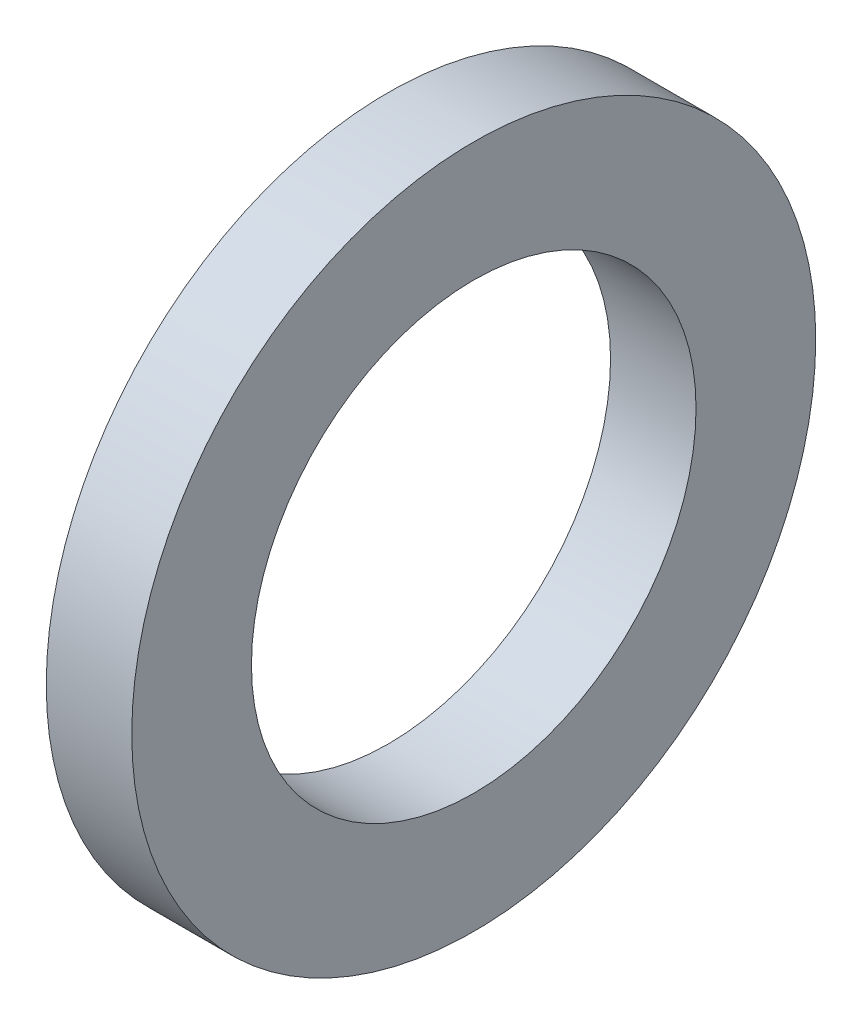
ISO-10303-21;
HEADER;
FILE_DESCRIPTION(('STEP AP214'),'2;1');
FILE_NAME('part.step','',(''),(''),'','','');
FILE_SCHEMA(('AUTOMOTIVE_DESIGN { 1 0 10303 214 1 1 1 1 }'));
ENDSEC;
DATA;
#1=APPLICATION_CONTEXT('core data for automotive mechanical design processes');
#2=APPLICATION_PROTOCOL_DEFINITION('international standard','automotive_design',2000,#1);
#3=PRODUCT_CONTEXT('',#1,'mechanical');
#4=PRODUCT('Part','Part','',(#3));
#5=PRODUCT_RELATED_PRODUCT_CATEGORY('part','',(#4));
#6=PRODUCT_DEFINITION_FORMATION('','',#4);
#7=PRODUCT_DEFINITION_CONTEXT('part definition',#1,'design');
#8=PRODUCT_DEFINITION('design','',#6,#7);
#9=PRODUCT_DEFINITION_SHAPE('','',#8);
#10=(LENGTH_UNIT() NAMED_UNIT(*) SI_UNIT(.MILLI.,.METRE.));
#11=(NAMED_UNIT(*) PLANE_ANGLE_UNIT() SI_UNIT($,.RADIAN.));
#12=(NAMED_UNIT(*) SI_UNIT($,.STERADIAN.) SOLID_ANGLE_UNIT());
#13=UNCERTAINTY_MEASURE_WITH_UNIT(LENGTH_MEASURE(1.E-05),#10,'distance_accuracy_value','');
#14=(GEOMETRIC_REPRESENTATION_CONTEXT(3) GLOBAL_UNCERTAINTY_ASSIGNED_CONTEXT((#13)) GLOBAL_UNIT_ASSIGNED_CONTEXT((#10,
#11,#12)) REPRESENTATION_CONTEXT('',''));
#15=CARTESIAN_POINT('',(0.,0.,0.));
#16=DIRECTION('',(0.,0.,1.));
#17=DIRECTION('',(1.,0.,0.));
#18=AXIS2_PLACEMENT_3D('',#15,#16,#17);
#19=CARTESIAN_POINT('',(0.5,0.,0.));
#20=DIRECTION('',(1.,0.,0.));
#21=DIRECTION('',(0.,0.,-1.));
#22=AXIS2_PLACEMENT_3D('',#19,#20,#21);
#23=PLANE('',#22);
#24=CARTESIAN_POINT('',(0.5,0.,0.));
#25=DIRECTION('',(1.,0.,0.));
#26=DIRECTION('',(0.,0.,-1.));
#27=AXIS2_PLACEMENT_3D('',#24,#25,#26);
#28=CIRCLE('',#27,4.);
#29=CARTESIAN_POINT('',(0.5,0.,-4.));
#30=VERTEX_POINT('',#29);
#31=EDGE_CURVE('E10',#30,#30,#28,.T.);
#32=ORIENTED_EDGE('',*,*,#31,.T.);
#33=EDGE_LOOP('',(#32));
#34=FACE_BOUND('',#33,.T.);
#35=CARTESIAN_POINT('',(0.5,0.,0.));
#36=DIRECTION('',(1.,0.,0.));
#37=DIRECTION('',(0.,0.,-1.));
#38=AXIS2_PLACEMENT_3D('',#35,#36,#37);
#39=CIRCLE('',#38,2.6);
#40=CARTESIAN_POINT('',(0.5,0.,-2.6));
#41=VERTEX_POINT('',#40);
#42=EDGE_CURVE('E25',#41,#41,#39,.T.);
#43=ORIENTED_EDGE('',*,*,#42,.F.);
#44=EDGE_LOOP('',(#43));
#45=FACE_BOUND('',#44,.T.);
#46=ADVANCED_FACE('F14',(#34,#45),#23,.T.);
#47=CARTESIAN_POINT('',(-0.5,0.,0.));
#48=DIRECTION('',(1.,0.,0.));
#49=DIRECTION('',(0.,0.,-1.));
#50=AXIS2_PLACEMENT_3D('',#47,#48,#49);
#51=PLANE('',#50);
#52=CARTESIAN_POINT('',(-0.5,0.,0.));
#53=DIRECTION('',(1.,0.,0.));
#54=DIRECTION('',(0.,0.,-1.));
#55=AXIS2_PLACEMENT_3D('',#52,#53,#54);
#56=CIRCLE('',#55,4.);
#57=CARTESIAN_POINT('',(-0.5,0.,-4.));
#58=VERTEX_POINT('',#57);
#59=EDGE_CURVE('E18',#58,#58,#56,.T.);
#60=ORIENTED_EDGE('',*,*,#59,.F.);
#61=EDGE_LOOP('',(#60));
#62=FACE_BOUND('',#61,.T.);
#63=CARTESIAN_POINT('',(-0.5,0.,0.));
#64=DIRECTION('',(1.,0.,0.));
#65=DIRECTION('',(0.,0.,-1.));
#66=AXIS2_PLACEMENT_3D('',#63,#64,#65);
#67=CIRCLE('',#66,2.6);
#68=CARTESIAN_POINT('',(-0.5,0.,-2.6));
#69=VERTEX_POINT('',#68);
#70=EDGE_CURVE('E27',#69,#69,#67,.T.);
#71=ORIENTED_EDGE('',*,*,#70,.T.);
#72=EDGE_LOOP('',(#71));
#73=FACE_BOUND('',#72,.T.);
#74=ADVANCED_FACE('F37',(#62,#73),#51,.F.);
#75=CARTESIAN_POINT('',(0.5,0.,0.));
#76=DIRECTION('',(-1.,0.,0.));
#77=DIRECTION('',(0.,0.,1.));
#78=AXIS2_PLACEMENT_3D('',#75,#76,#77);
#79=CYLINDRICAL_SURFACE('',#78,4.);
#80=ORIENTED_EDGE('',*,*,#31,.F.);
#81=EDGE_LOOP('',(#80));
#82=FACE_BOUND('',#81,.T.);
#83=ORIENTED_EDGE('',*,*,#59,.T.);
#84=EDGE_LOOP('',(#83));
#85=FACE_BOUND('',#84,.T.);
#86=ADVANCED_FACE('F16',(#82,#85),#79,.T.);
#87=CARTESIAN_POINT('',(0.5,0.,0.));
#88=DIRECTION('',(-1.,0.,0.));
#89=DIRECTION('',(0.,0.,1.));
#90=AXIS2_PLACEMENT_3D('',#87,#88,#89);
#91=CYLINDRICAL_SURFACE('',#90,2.6);
#92=ORIENTED_EDGE('',*,*,#42,.T.);
#93=EDGE_LOOP('',(#92));
#94=FACE_BOUND('',#93,.T.);
#95=ORIENTED_EDGE('',*,*,#70,.F.);
#96=EDGE_LOOP('',(#95));
#97=FACE_BOUND('',#96,.T.);
#98=ADVANCED_FACE('F33',(#94,#97),#91,.F.);
#99=CLOSED_SHELL('',(#46,#74,#86,#98));
#100=MANIFOLD_SOLID_BREP('B1',#99);
#101=ADVANCED_BREP_SHAPE_REPRESENTATION('',(#18,#100),#14);
#102=SHAPE_DEFINITION_REPRESENTATION(#9,#101);
ENDSEC;
END-ISO-10303-21;
